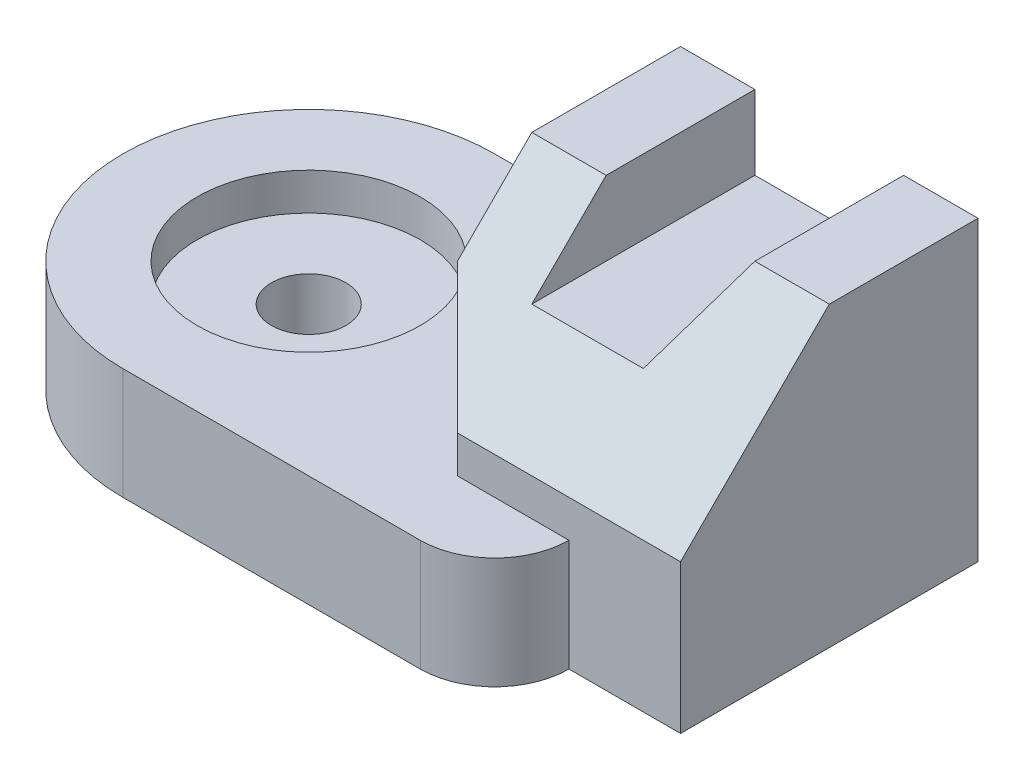
ISO-10303-21;
HEADER;
FILE_DESCRIPTION(('STEP AP214'),'2;1');
FILE_NAME('part.step','',(''),(''),'','','');
FILE_SCHEMA(('AUTOMOTIVE_DESIGN { 1 0 10303 214 1 1 1 1 }'));
ENDSEC;
DATA;
#1=APPLICATION_CONTEXT('core data for automotive mechanical design processes');
#2=APPLICATION_PROTOCOL_DEFINITION('international standard','automotive_design',2000,#1);
#3=PRODUCT_CONTEXT('',#1,'mechanical');
#4=PRODUCT('Part','Part','',(#3));
#5=PRODUCT_RELATED_PRODUCT_CATEGORY('part','',(#4));
#6=PRODUCT_DEFINITION_FORMATION('','',#4);
#7=PRODUCT_DEFINITION_CONTEXT('part definition',#1,'design');
#8=PRODUCT_DEFINITION('design','',#6,#7);
#9=PRODUCT_DEFINITION_SHAPE('','',#8);
#10=(LENGTH_UNIT() NAMED_UNIT(*) SI_UNIT(.MILLI.,.METRE.));
#11=(NAMED_UNIT(*) PLANE_ANGLE_UNIT() SI_UNIT($,.RADIAN.));
#12=(NAMED_UNIT(*) SI_UNIT($,.STERADIAN.) SOLID_ANGLE_UNIT());
#13=UNCERTAINTY_MEASURE_WITH_UNIT(LENGTH_MEASURE(1.E-05),#10,'distance_accuracy_value','');
#14=(GEOMETRIC_REPRESENTATION_CONTEXT(3) GLOBAL_UNCERTAINTY_ASSIGNED_CONTEXT((#13)) GLOBAL_UNIT_ASSIGNED_CONTEXT((#10,
#11,#12)) REPRESENTATION_CONTEXT('',''));
#15=CARTESIAN_POINT('',(0.,0.,0.));
#16=DIRECTION('',(0.,0.,1.));
#17=DIRECTION('',(1.,0.,0.));
#18=AXIS2_PLACEMENT_3D('',#15,#16,#17);
#19=CARTESIAN_POINT('',(0.,8.,0.));
#20=DIRECTION('',(0.,1.,0.));
#21=DIRECTION('',(0.,0.,1.));
#22=AXIS2_PLACEMENT_3D('',#19,#20,#21);
#23=PLANE('',#22);
#24=DIRECTION('',(0.,0.,-1.));
#25=VECTOR('',#24,1.);
#26=CARTESIAN_POINT('',(7.,8.,8.));
#27=LINE('',#26,#25);
#28=CARTESIAN_POINT('',(7.,8.,-0.999999999999998));
#29=VERTEX_POINT('',#28);
#30=CARTESIAN_POINT('',(7.,8.,-5.));
#31=VERTEX_POINT('',#30);
#32=EDGE_CURVE('E245',#29,#31,#27,.T.);
#33=ORIENTED_EDGE('',*,*,#32,.T.);
#34=DIRECTION('',(-1.,0.,0.));
#35=VECTOR('',#34,1.);
#36=CARTESIAN_POINT('',(13.,8.,-5.));
#37=LINE('',#36,#35);
#38=CARTESIAN_POINT('',(5.,8.,-5.));
#39=VERTEX_POINT('',#38);
#40=EDGE_CURVE('E159',#31,#39,#37,.T.);
#41=ORIENTED_EDGE('',*,*,#40,.T.);
#42=DIRECTION('',(0.,0.,1.));
#43=VECTOR('',#42,1.);
#44=CARTESIAN_POINT('',(5.,8.,1.));
#45=LINE('',#44,#43);
#46=CARTESIAN_POINT('',(5.,8.,-1.));
#47=VERTEX_POINT('',#46);
#48=EDGE_CURVE('E158',#39,#47,#45,.T.);
#49=ORIENTED_EDGE('',*,*,#48,.T.);
#50=DIRECTION('',(-1.,0.,0.));
#51=VECTOR('',#50,1.);
#52=CARTESIAN_POINT('',(0.,8.,-1.));
#53=LINE('',#52,#51);
#54=EDGE_CURVE('E232',#29,#47,#53,.T.);
#55=ORIENTED_EDGE('',*,*,#54,.F.);
#56=EDGE_LOOP('',(#33,#41,#49,#55));
#57=FACE_BOUND('',#56,.T.);
#58=ADVANCED_FACE('F33',(#57),#23,.T.);
#59=CARTESIAN_POINT('',(0.,3.,0.));
#60=DIRECTION('',(0.,-1.,0.));
#61=DIRECTION('',(0.,0.,-1.));
#62=AXIS2_PLACEMENT_3D('',#59,#60,#61);
#63=CYLINDRICAL_SURFACE('',#62,1.);
#64=CARTESIAN_POINT('',(0.,0.,0.));
#65=DIRECTION('',(0.,1.,0.));
#66=DIRECTION('',(0.,0.,1.));
#67=AXIS2_PLACEMENT_3D('',#64,#65,#66);
#68=CIRCLE('',#67,1.);
#69=CARTESIAN_POINT('',(0.,0.,1.));
#70=VERTEX_POINT('',#69);
#71=EDGE_CURVE('E190',#70,#70,#68,.T.);
#72=ORIENTED_EDGE('',*,*,#71,.F.);
#73=EDGE_LOOP('',(#72));
#74=FACE_BOUND('',#73,.T.);
#75=CARTESIAN_POINT('',(0.,2.,0.));
#76=DIRECTION('',(0.,1.,0.));
#77=DIRECTION('',(0.,0.,1.));
#78=AXIS2_PLACEMENT_3D('',#75,#76,#77);
#79=CIRCLE('',#78,1.);
#80=CARTESIAN_POINT('',(0.,2.,1.));
#81=VERTEX_POINT('',#80);
#82=EDGE_CURVE('E187',#81,#81,#79,.T.);
#83=ORIENTED_EDGE('',*,*,#82,.T.);
#84=EDGE_LOOP('',(#83));
#85=FACE_BOUND('',#84,.T.);
#86=ADVANCED_FACE('F306',(#74,#85),#63,.F.);
#87=CARTESIAN_POINT('',(0.,3.,0.));
#88=DIRECTION('',(0.,1.,0.));
#89=DIRECTION('',(0.,0.,1.));
#90=AXIS2_PLACEMENT_3D('',#87,#88,#89);
#91=PLANE('',#90);
#92=DIRECTION('',(1.,0.,0.));
#93=VECTOR('',#92,1.);
#94=CARTESIAN_POINT('',(13.,3.,3.));
#95=LINE('',#94,#93);
#96=CARTESIAN_POINT('',(7.,3.,3.));
#97=VERTEX_POINT('',#96);
#98=CARTESIAN_POINT('',(10.,3.,3.));
#99=VERTEX_POINT('',#98);
#100=EDGE_CURVE('E174',#97,#99,#95,.T.);
#101=ORIENTED_EDGE('',*,*,#100,.F.);
#102=DIRECTION('',(0.707106781186548,0.,0.707106781186548));
#103=VECTOR('',#102,1.);
#104=CARTESIAN_POINT('',(7.,3.,3.));
#105=LINE('',#104,#103);
#106=CARTESIAN_POINT('',(5.,3.,1.));
#107=VERTEX_POINT('',#106);
#108=EDGE_CURVE('E170',#107,#97,#105,.T.);
#109=ORIENTED_EDGE('',*,*,#108,.F.);
#110=DIRECTION('',(0.,0.,1.));
#111=VECTOR('',#110,1.);
#112=CARTESIAN_POINT('',(5.,3.,1.));
#113=LINE('',#112,#111);
#114=CARTESIAN_POINT('',(5.,3.,-5.));
#115=VERTEX_POINT('',#114);
#116=EDGE_CURVE('E167',#115,#107,#113,.T.);
#117=ORIENTED_EDGE('',*,*,#116,.F.);
#118=DIRECTION('',(-1.,0.,0.));
#119=VECTOR('',#118,1.);
#120=CARTESIAN_POINT('',(0.,3.,-5.));
#121=LINE('',#120,#119);
#122=CARTESIAN_POINT('',(0.,3.,-5.));
#123=VERTEX_POINT('',#122);
#124=EDGE_CURVE('E202',#115,#123,#121,.T.);
#125=ORIENTED_EDGE('',*,*,#124,.T.);
#126=CARTESIAN_POINT('',(0.,3.,0.));
#127=DIRECTION('',(0.,1.,0.));
#128=DIRECTION('',(0.,0.,1.));
#129=AXIS2_PLACEMENT_3D('',#126,#127,#128);
#130=CIRCLE('',#129,5.);
#131=CARTESIAN_POINT('',(0.,3.,5.));
#132=VERTEX_POINT('',#131);
#133=EDGE_CURVE('E194',#123,#132,#130,.T.);
#134=ORIENTED_EDGE('',*,*,#133,.T.);
#135=DIRECTION('',(1.,0.,0.));
#136=VECTOR('',#135,1.);
#137=CARTESIAN_POINT('',(8.,3.,5.));
#138=LINE('',#137,#136);
#139=CARTESIAN_POINT('',(8.,3.,5.));
#140=VERTEX_POINT('',#139);
#141=EDGE_CURVE('E197',#132,#140,#138,.T.);
#142=ORIENTED_EDGE('',*,*,#141,.T.);
#143=CARTESIAN_POINT('',(8.,3.,3.));
#144=DIRECTION('',(0.,1.,0.));
#145=DIRECTION('',(0.,0.,-1.));
#146=AXIS2_PLACEMENT_3D('',#143,#144,#145);
#147=CIRCLE('',#146,2.);
#148=EDGE_CURVE('E200',#140,#99,#147,.T.);
#149=ORIENTED_EDGE('',*,*,#148,.T.);
#150=EDGE_LOOP('',(#101,#109,#117,#125,#134,#142,#149));
#151=FACE_BOUND('',#150,.T.);
#152=CARTESIAN_POINT('',(0.,3.,0.));
#153=DIRECTION('',(0.,1.,0.));
#154=DIRECTION('',(0.,0.,1.));
#155=AXIS2_PLACEMENT_3D('',#152,#153,#154);
#156=CIRCLE('',#155,3.);
#157=CARTESIAN_POINT('',(0.,3.,3.));
#158=VERTEX_POINT('',#157);
#159=EDGE_CURVE('E183',#158,#158,#156,.T.);
#160=ORIENTED_EDGE('',*,*,#159,.F.);
#161=EDGE_LOOP('',(#160));
#162=FACE_BOUND('',#161,.T.);
#163=ADVANCED_FACE('F269',(#151,#162),#91,.T.);
#164=CARTESIAN_POINT('',(0.,0.,0.));
#165=DIRECTION('',(0.,1.,0.));
#166=DIRECTION('',(0.,0.,1.));
#167=AXIS2_PLACEMENT_3D('',#164,#165,#166);
#168=PLANE('',#167);
#169=CARTESIAN_POINT('',(0.,0.,0.));
#170=DIRECTION('',(0.,1.,0.));
#171=DIRECTION('',(0.,0.,1.));
#172=AXIS2_PLACEMENT_3D('',#169,#170,#171);
#173=CIRCLE('',#172,5.);
#174=CARTESIAN_POINT('',(0.,0.,-5.));
#175=VERTEX_POINT('',#174);
#176=CARTESIAN_POINT('',(0.,0.,5.));
#177=VERTEX_POINT('',#176);
#178=EDGE_CURVE('E193',#175,#177,#173,.T.);
#179=ORIENTED_EDGE('',*,*,#178,.F.);
#180=DIRECTION('',(-1.,0.,0.));
#181=VECTOR('',#180,1.);
#182=CARTESIAN_POINT('',(0.,0.,-5.));
#183=LINE('',#182,#181);
#184=CARTESIAN_POINT('',(13.,0.,-5.));
#185=VERTEX_POINT('',#184);
#186=EDGE_CURVE('E198',#185,#175,#183,.T.);
#187=ORIENTED_EDGE('',*,*,#186,.F.);
#188=DIRECTION('',(0.,0.,-1.));
#189=VECTOR('',#188,1.);
#190=CARTESIAN_POINT('',(13.,0.,-5.));
#191=LINE('',#190,#189);
#192=CARTESIAN_POINT('',(13.,0.,3.));
#193=VERTEX_POINT('',#192);
#194=EDGE_CURVE('E214',#193,#185,#191,.T.);
#195=ORIENTED_EDGE('',*,*,#194,.F.);
#196=DIRECTION('',(1.,0.,0.));
#197=VECTOR('',#196,1.);
#198=CARTESIAN_POINT('',(13.,0.,3.));
#199=LINE('',#198,#197);
#200=CARTESIAN_POINT('',(10.,0.,3.));
#201=VERTEX_POINT('',#200);
#202=EDGE_CURVE('E211',#201,#193,#199,.T.);
#203=ORIENTED_EDGE('',*,*,#202,.F.);
#204=CARTESIAN_POINT('',(8.,0.,3.));
#205=DIRECTION('',(0.,1.,0.));
#206=DIRECTION('',(0.,0.,-1.));
#207=AXIS2_PLACEMENT_3D('',#204,#205,#206);
#208=CIRCLE('',#207,2.);
#209=CARTESIAN_POINT('',(8.,0.,5.));
#210=VERTEX_POINT('',#209);
#211=EDGE_CURVE('E209',#210,#201,#208,.T.);
#212=ORIENTED_EDGE('',*,*,#211,.F.);
#213=DIRECTION('',(1.,0.,0.));
#214=VECTOR('',#213,1.);
#215=CARTESIAN_POINT('',(8.,0.,5.));
#216=LINE('',#215,#214);
#217=EDGE_CURVE('E207',#177,#210,#216,.T.);
#218=ORIENTED_EDGE('',*,*,#217,.F.);
#219=EDGE_LOOP('',(#179,#187,#195,#203,#212,#218));
#220=FACE_BOUND('',#219,.T.);
#221=ORIENTED_EDGE('',*,*,#71,.T.);
#222=EDGE_LOOP('',(#221));
#223=FACE_BOUND('',#222,.T.);
#224=ADVANCED_FACE('F285',(#220,#223),#168,.F.);
#225=CARTESIAN_POINT('',(0.,3.,0.));
#226=DIRECTION('',(0.,-1.,0.));
#227=DIRECTION('',(0.,0.,-1.));
#228=AXIS2_PLACEMENT_3D('',#225,#226,#227);
#229=CYLINDRICAL_SURFACE('',#228,5.);
#230=ORIENTED_EDGE('',*,*,#178,.T.);
#231=DIRECTION('',(0.,-1.,0.));
#232=VECTOR('',#231,1.);
#233=CARTESIAN_POINT('',(0.,3.,5.));
#234=LINE('',#233,#232);
#235=EDGE_CURVE('E229',#132,#177,#234,.T.);
#236=ORIENTED_EDGE('',*,*,#235,.F.);
#237=ORIENTED_EDGE('',*,*,#133,.F.);
#238=DIRECTION('',(0.,-1.,0.));
#239=VECTOR('',#238,1.);
#240=CARTESIAN_POINT('',(0.,3.,-5.));
#241=LINE('',#240,#239);
#242=EDGE_CURVE('E204',#123,#175,#241,.T.);
#243=ORIENTED_EDGE('',*,*,#242,.T.);
#244=EDGE_LOOP('',(#230,#236,#237,#243));
#245=FACE_BOUND('',#244,.T.);
#246=ADVANCED_FACE('F35',(#245),#229,.T.);
#247=CARTESIAN_POINT('',(8.,3.,5.));
#248=DIRECTION('',(0.,0.,-1.));
#249=DIRECTION('',(-1.,0.,0.));
#250=AXIS2_PLACEMENT_3D('',#247,#248,#249);
#251=PLANE('',#250);
#252=ORIENTED_EDGE('',*,*,#217,.T.);
#253=DIRECTION('',(0.,-1.,0.));
#254=VECTOR('',#253,1.);
#255=CARTESIAN_POINT('',(8.,3.,5.));
#256=LINE('',#255,#254);
#257=EDGE_CURVE('E226',#140,#210,#256,.T.);
#258=ORIENTED_EDGE('',*,*,#257,.F.);
#259=ORIENTED_EDGE('',*,*,#141,.F.);
#260=ORIENTED_EDGE('',*,*,#235,.T.);
#261=EDGE_LOOP('',(#252,#258,#259,#260));
#262=FACE_BOUND('',#261,.T.);
#263=ADVANCED_FACE('F295',(#262),#251,.F.);
#264=CARTESIAN_POINT('',(8.,3.,3.));
#265=DIRECTION('',(0.,-1.,0.));
#266=DIRECTION('',(0.,0.,-1.));
#267=AXIS2_PLACEMENT_3D('',#264,#265,#266);
#268=CYLINDRICAL_SURFACE('',#267,2.);
#269=ORIENTED_EDGE('',*,*,#211,.T.);
#270=DIRECTION('',(0.,-1.,0.));
#271=VECTOR('',#270,1.);
#272=CARTESIAN_POINT('',(10.,3.,3.));
#273=LINE('',#272,#271);
#274=EDGE_CURVE('E223',#99,#201,#273,.T.);
#275=ORIENTED_EDGE('',*,*,#274,.F.);
#276=ORIENTED_EDGE('',*,*,#148,.F.);
#277=ORIENTED_EDGE('',*,*,#257,.T.);
#278=EDGE_LOOP('',(#269,#275,#276,#277));
#279=FACE_BOUND('',#278,.T.);
#280=ADVANCED_FACE('F297',(#279),#268,.T.);
#281=CARTESIAN_POINT('',(13.,3.,3.));
#282=DIRECTION('',(0.,0.,-1.));
#283=DIRECTION('',(-1.,0.,0.));
#284=AXIS2_PLACEMENT_3D('',#281,#282,#283);
#285=PLANE('',#284);
#286=DIRECTION('',(0.,-1.,0.));
#287=VECTOR('',#286,1.);
#288=CARTESIAN_POINT('',(13.,3.,3.));
#289=LINE('',#288,#287);
#290=CARTESIAN_POINT('',(13.,4.,3.));
#291=VERTEX_POINT('',#290);
#292=EDGE_CURVE('E221',#291,#193,#289,.T.);
#293=ORIENTED_EDGE('',*,*,#292,.F.);
#294=DIRECTION('',(1.,0.,0.));
#295=VECTOR('',#294,1.);
#296=CARTESIAN_POINT('',(0.,4.,3.));
#297=LINE('',#296,#295);
#298=CARTESIAN_POINT('',(7.,4.,3.));
#299=VERTEX_POINT('',#298);
#300=EDGE_CURVE('E253',#299,#291,#297,.T.);
#301=ORIENTED_EDGE('',*,*,#300,.F.);
#302=DIRECTION('',(0.,-1.,0.));
#303=VECTOR('',#302,1.);
#304=CARTESIAN_POINT('',(7.,8.,3.));
#305=LINE('',#304,#303);
#306=EDGE_CURVE('E162',#299,#97,#305,.T.);
#307=ORIENTED_EDGE('',*,*,#306,.T.);
#308=ORIENTED_EDGE('',*,*,#100,.T.);
#309=ORIENTED_EDGE('',*,*,#274,.T.);
#310=ORIENTED_EDGE('',*,*,#202,.T.);
#311=EDGE_LOOP('',(#293,#301,#307,#308,#309,#310));
#312=FACE_BOUND('',#311,.T.);
#313=ADVANCED_FACE('F277',(#312),#285,.F.);
#314=CARTESIAN_POINT('',(13.,3.,-5.));
#315=DIRECTION('',(-1.,0.,0.));
#316=DIRECTION('',(0.,0.,1.));
#317=AXIS2_PLACEMENT_3D('',#314,#315,#316);
#318=PLANE('',#317);
#319=DIRECTION('',(0.,0.,-1.));
#320=VECTOR('',#319,1.);
#321=CARTESIAN_POINT('',(13.,8.,3.));
#322=LINE('',#321,#320);
#323=CARTESIAN_POINT('',(13.,8.,-1.));
#324=VERTEX_POINT('',#323);
#325=CARTESIAN_POINT('',(13.,8.,-5.));
#326=VERTEX_POINT('',#325);
#327=EDGE_CURVE('E156',#324,#326,#322,.T.);
#328=ORIENTED_EDGE('',*,*,#327,.F.);
#329=DIRECTION('',(0.,0.707106781186548,-0.707106781186548));
#330=VECTOR('',#329,1.);
#331=CARTESIAN_POINT('',(13.,4.,3.));
#332=LINE('',#331,#330);
#333=EDGE_CURVE('E56',#291,#324,#332,.T.);
#334=ORIENTED_EDGE('',*,*,#333,.F.);
#335=ORIENTED_EDGE('',*,*,#292,.T.);
#336=ORIENTED_EDGE('',*,*,#194,.T.);
#337=DIRECTION('',(0.,-1.,0.));
#338=VECTOR('',#337,1.);
#339=CARTESIAN_POINT('',(13.,3.,-5.));
#340=LINE('',#339,#338);
#341=EDGE_CURVE('E219',#326,#185,#340,.T.);
#342=ORIENTED_EDGE('',*,*,#341,.F.);
#343=EDGE_LOOP('',(#328,#334,#335,#336,#342));
#344=FACE_BOUND('',#343,.T.);
#345=ADVANCED_FACE('F281',(#344),#318,.F.);
#346=CARTESIAN_POINT('',(0.,3.,-5.));
#347=DIRECTION('',(0.,0.,1.));
#348=DIRECTION('',(1.,0.,0.));
#349=AXIS2_PLACEMENT_3D('',#346,#347,#348);
#350=PLANE('',#349);
#351=ORIENTED_EDGE('',*,*,#40,.F.);
#352=DIRECTION('',(0.,1.,0.));
#353=VECTOR('',#352,1.);
#354=CARTESIAN_POINT('',(7.,8.,-5.));
#355=LINE('',#354,#353);
#356=CARTESIAN_POINT('',(7.,6.,-5.));
#357=VERTEX_POINT('',#356);
#358=EDGE_CURVE('E142',#357,#31,#355,.T.);
#359=ORIENTED_EDGE('',*,*,#358,.F.);
#360=DIRECTION('',(-1.,0.,0.));
#361=VECTOR('',#360,1.);
#362=CARTESIAN_POINT('',(7.,6.,-5.));
#363=LINE('',#362,#361);
#364=CARTESIAN_POINT('',(10.,6.,-5.));
#365=VERTEX_POINT('',#364);
#366=EDGE_CURVE('E152',#365,#357,#363,.T.);
#367=ORIENTED_EDGE('',*,*,#366,.F.);
#368=DIRECTION('',(-0.447213595499958,-0.894427190999916,0.));
#369=VECTOR('',#368,1.);
#370=CARTESIAN_POINT('',(10.,6.,-5.));
#371=LINE('',#370,#369);
#372=CARTESIAN_POINT('',(11.,8.,-5.));
#373=VERTEX_POINT('',#372);
#374=EDGE_CURVE('E136',#373,#365,#371,.T.);
#375=ORIENTED_EDGE('',*,*,#374,.F.);
#376=EDGE_CURVE('E149',#326,#373,#37,.T.);
#377=ORIENTED_EDGE('',*,*,#376,.F.);
#378=ORIENTED_EDGE('',*,*,#341,.T.);
#379=ORIENTED_EDGE('',*,*,#186,.T.);
#380=ORIENTED_EDGE('',*,*,#242,.F.);
#381=ORIENTED_EDGE('',*,*,#124,.F.);
#382=DIRECTION('',(0.,-1.,0.));
#383=VECTOR('',#382,1.);
#384=CARTESIAN_POINT('',(5.,8.,-5.));
#385=LINE('',#384,#383);
#386=EDGE_CURVE('E180',#39,#115,#385,.T.);
#387=ORIENTED_EDGE('',*,*,#386,.F.);
#388=EDGE_LOOP('',(#351,#359,#367,#375,#377,#378,#379,#380,#381,#387));
#389=FACE_BOUND('',#388,.T.);
#390=ADVANCED_FACE('F147',(#389),#350,.F.);
#391=CARTESIAN_POINT('',(0.,2.,0.));
#392=DIRECTION('',(0.,1.,0.));
#393=DIRECTION('',(0.,0.,1.));
#394=AXIS2_PLACEMENT_3D('',#391,#392,#393);
#395=CYLINDRICAL_SURFACE('',#394,3.);
#396=CARTESIAN_POINT('',(0.,2.,0.));
#397=DIRECTION('',(0.,1.,0.));
#398=DIRECTION('',(0.,0.,1.));
#399=AXIS2_PLACEMENT_3D('',#396,#397,#398);
#400=CIRCLE('',#399,3.);
#401=CARTESIAN_POINT('',(0.,2.,3.));
#402=VERTEX_POINT('',#401);
#403=EDGE_CURVE('E184',#402,#402,#400,.T.);
#404=ORIENTED_EDGE('',*,*,#403,.F.);
#405=EDGE_LOOP('',(#404));
#406=FACE_BOUND('',#405,.T.);
#407=ORIENTED_EDGE('',*,*,#159,.T.);
#408=EDGE_LOOP('',(#407));
#409=FACE_BOUND('',#408,.T.);
#410=ADVANCED_FACE('F329',(#406,#409),#395,.F.);
#411=CARTESIAN_POINT('',(0.,2.,0.));
#412=DIRECTION('',(0.,1.,0.));
#413=DIRECTION('',(0.,0.,1.));
#414=AXIS2_PLACEMENT_3D('',#411,#412,#413);
#415=PLANE('',#414);
#416=ORIENTED_EDGE('',*,*,#82,.F.);
#417=EDGE_LOOP('',(#416));
#418=FACE_BOUND('',#417,.T.);
#419=ORIENTED_EDGE('',*,*,#403,.T.);
#420=EDGE_LOOP('',(#419));
#421=FACE_BOUND('',#420,.T.);
#422=ADVANCED_FACE('F324',(#418,#421),#415,.T.);
#423=CARTESIAN_POINT('',(5.,8.,1.));
#424=DIRECTION('',(1.,0.,0.));
#425=DIRECTION('',(0.,0.,-1.));
#426=AXIS2_PLACEMENT_3D('',#423,#424,#425);
#427=PLANE('',#426);
#428=DIRECTION('',(0.,-1.,0.));
#429=VECTOR('',#428,1.);
#430=CARTESIAN_POINT('',(5.,8.,1.));
#431=LINE('',#430,#429);
#432=CARTESIAN_POINT('',(5.,6.,1.));
#433=VERTEX_POINT('',#432);
#434=EDGE_CURVE('E178',#433,#107,#431,.T.);
#435=ORIENTED_EDGE('',*,*,#434,.F.);
#436=DIRECTION('',(0.,0.707106781186548,-0.707106781186548));
#437=VECTOR('',#436,1.);
#438=CARTESIAN_POINT('',(5.,7.,0.));
#439=LINE('',#438,#437);
#440=EDGE_CURVE('E171',#433,#47,#439,.T.);
#441=ORIENTED_EDGE('',*,*,#440,.T.);
#442=ORIENTED_EDGE('',*,*,#48,.F.);
#443=ORIENTED_EDGE('',*,*,#386,.T.);
#444=ORIENTED_EDGE('',*,*,#116,.T.);
#445=EDGE_LOOP('',(#435,#441,#442,#443,#444));
#446=FACE_BOUND('',#445,.T.);
#447=ADVANCED_FACE('F261',(#446),#427,.F.);
#448=CARTESIAN_POINT('',(7.,8.,3.));
#449=DIRECTION('',(0.707106781186548,0.,-0.707106781186548));
#450=DIRECTION('',(-0.707106781186548,0.,-0.707106781186548));
#451=AXIS2_PLACEMENT_3D('',#448,#449,#450);
#452=PLANE('',#451);
#453=ORIENTED_EDGE('',*,*,#306,.F.);
#454=DIRECTION('',(-0.577350269189626,0.577350269189626,-0.577350269189626));
#455=VECTOR('',#454,1.);
#456=CARTESIAN_POINT('',(5.66666666666667,5.33333333333333,1.66666666666667));
#457=LINE('',#456,#455);
#458=EDGE_CURVE('E255',#299,#433,#457,.T.);
#459=ORIENTED_EDGE('',*,*,#458,.T.);
#460=ORIENTED_EDGE('',*,*,#434,.T.);
#461=ORIENTED_EDGE('',*,*,#108,.T.);
#462=EDGE_LOOP('',(#453,#459,#460,#461));
#463=FACE_BOUND('',#462,.T.);
#464=ADVANCED_FACE('F273',(#463),#452,.F.);
#465=DIRECTION('',(0.,0.,-1.));
#466=VECTOR('',#465,1.);
#467=CARTESIAN_POINT('',(11.,8.,8.));
#468=LINE('',#467,#466);
#469=CARTESIAN_POINT('',(11.,8.,-1.));
#470=VERTEX_POINT('',#469);
#471=EDGE_CURVE('E133',#470,#373,#468,.T.);
#472=ORIENTED_EDGE('',*,*,#471,.F.);
#473=EDGE_CURVE('E235',#324,#470,#53,.T.);
#474=ORIENTED_EDGE('',*,*,#473,.F.);
#475=ORIENTED_EDGE('',*,*,#327,.T.);
#476=ORIENTED_EDGE('',*,*,#376,.T.);
#477=EDGE_LOOP('',(#472,#474,#475,#476));
#478=FACE_BOUND('',#477,.T.);
#479=ADVANCED_FACE('F154',(#478),#23,.T.);
#480=CARTESIAN_POINT('',(0.,4.,3.));
#481=DIRECTION('',(0.,-0.707106781186548,-0.707106781186548));
#482=DIRECTION('',(0.,0.707106781186548,-0.707106781186548));
#483=AXIS2_PLACEMENT_3D('',#480,#481,#482);
#484=PLANE('',#483);
#485=DIRECTION('',(-1.,0.,0.));
#486=VECTOR('',#485,1.);
#487=CARTESIAN_POINT('',(0.,6.,1.));
#488=LINE('',#487,#486);
#489=CARTESIAN_POINT('',(10.,6.,0.999999999999999));
#490=VERTEX_POINT('',#489);
#491=CARTESIAN_POINT('',(7.,6.,1.));
#492=VERTEX_POINT('',#491);
#493=EDGE_CURVE('E41',#490,#492,#488,.T.);
#494=ORIENTED_EDGE('',*,*,#493,.T.);
#495=DIRECTION('',(0.,0.707106781186548,-0.707106781186548));
#496=VECTOR('',#495,1.);
#497=CARTESIAN_POINT('',(7.,4.,3.));
#498=LINE('',#497,#496);
#499=EDGE_CURVE('E11',#492,#29,#498,.T.);
#500=ORIENTED_EDGE('',*,*,#499,.T.);
#501=ORIENTED_EDGE('',*,*,#54,.T.);
#502=ORIENTED_EDGE('',*,*,#440,.F.);
#503=ORIENTED_EDGE('',*,*,#458,.F.);
#504=ORIENTED_EDGE('',*,*,#300,.T.);
#505=ORIENTED_EDGE('',*,*,#333,.T.);
#506=ORIENTED_EDGE('',*,*,#473,.T.);
#507=DIRECTION('',(-0.333333333333334,-0.666666666666667,0.666666666666667));
#508=VECTOR('',#507,1.);
#509=CARTESIAN_POINT('',(8.,2.,5.));
#510=LINE('',#509,#508);
#511=EDGE_CURVE('E139',#470,#490,#510,.T.);
#512=ORIENTED_EDGE('',*,*,#511,.T.);
#513=EDGE_LOOP('',(#494,#500,#501,#502,#503,#504,#505,#506,#512));
#514=FACE_BOUND('',#513,.T.);
#515=ADVANCED_FACE('F238',(#514),#484,.F.);
#516=CARTESIAN_POINT('',(7.,8.,8.));
#517=DIRECTION('',(-1.,0.,0.));
#518=DIRECTION('',(0.,0.,1.));
#519=AXIS2_PLACEMENT_3D('',#516,#517,#518);
#520=PLANE('',#519);
#521=DIRECTION('',(0.,0.,-1.));
#522=VECTOR('',#521,1.);
#523=CARTESIAN_POINT('',(7.,6.,8.));
#524=LINE('',#523,#522);
#525=EDGE_CURVE('E243',#492,#357,#524,.T.);
#526=ORIENTED_EDGE('',*,*,#525,.T.);
#527=ORIENTED_EDGE('',*,*,#358,.T.);
#528=ORIENTED_EDGE('',*,*,#32,.F.);
#529=ORIENTED_EDGE('',*,*,#499,.F.);
#530=EDGE_LOOP('',(#526,#527,#528,#529));
#531=FACE_BOUND('',#530,.T.);
#532=ADVANCED_FACE('F320',(#531),#520,.F.);
#533=CARTESIAN_POINT('',(7.,6.,8.));
#534=DIRECTION('',(0.,-1.,0.));
#535=DIRECTION('',(0.,0.,-1.));
#536=AXIS2_PLACEMENT_3D('',#533,#534,#535);
#537=PLANE('',#536);
#538=DIRECTION('',(0.,0.,-1.));
#539=VECTOR('',#538,1.);
#540=CARTESIAN_POINT('',(10.,6.,8.));
#541=LINE('',#540,#539);
#542=EDGE_CURVE('E48',#490,#365,#541,.T.);
#543=ORIENTED_EDGE('',*,*,#542,.T.);
#544=ORIENTED_EDGE('',*,*,#366,.T.);
#545=ORIENTED_EDGE('',*,*,#525,.F.);
#546=ORIENTED_EDGE('',*,*,#493,.F.);
#547=EDGE_LOOP('',(#543,#544,#545,#546));
#548=FACE_BOUND('',#547,.T.);
#549=ADVANCED_FACE('F242',(#548),#537,.F.);
#550=CARTESIAN_POINT('',(10.,6.,8.));
#551=DIRECTION('',(0.894427190999916,-0.447213595499958,0.));
#552=DIRECTION('',(0.447213595499958,0.894427190999916,0.));
#553=AXIS2_PLACEMENT_3D('',#550,#551,#552);
#554=PLANE('',#553);
#555=ORIENTED_EDGE('',*,*,#471,.T.);
#556=ORIENTED_EDGE('',*,*,#374,.T.);
#557=ORIENTED_EDGE('',*,*,#542,.F.);
#558=ORIENTED_EDGE('',*,*,#511,.F.);
#559=EDGE_LOOP('',(#555,#556,#557,#558));
#560=FACE_BOUND('',#559,.T.);
#561=ADVANCED_FACE('F135',(#560),#554,.F.);
#562=CLOSED_SHELL('',(#58,#86,#163,#224,#246,#263,#280,#313,#345,#390,#410,#422,#447,#464,#479,
#515,#532,#549,#561));
#563=MANIFOLD_SOLID_BREP('B2',#562);
#564=ADVANCED_BREP_SHAPE_REPRESENTATION('',(#18,#563),#14);
#565=SHAPE_DEFINITION_REPRESENTATION(#9,#564);
ENDSEC;
END-ISO-10303-21;
